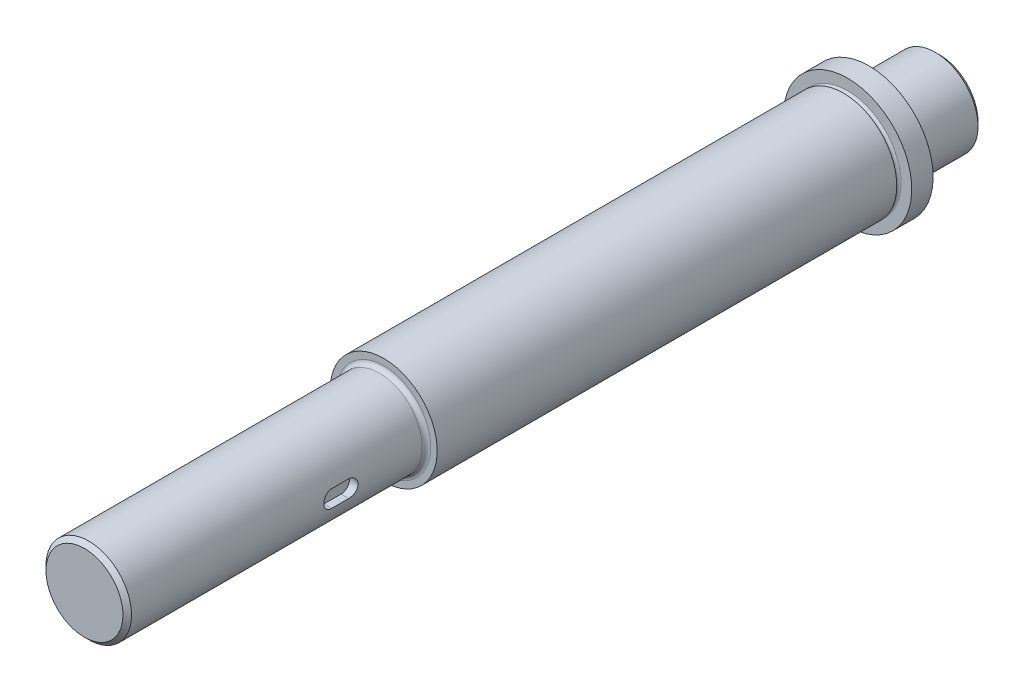
ISO-10303-21;
HEADER;
FILE_DESCRIPTION(('STEP AP214'),'2;1');
FILE_NAME('part.step','',(''),(''),'','','');
FILE_SCHEMA(('AUTOMOTIVE_DESIGN { 1 0 10303 214 1 1 1 1 }'));
ENDSEC;
DATA;
#1=APPLICATION_CONTEXT('core data for automotive mechanical design processes');
#2=APPLICATION_PROTOCOL_DEFINITION('international standard','automotive_design',2000,#1);
#3=PRODUCT_CONTEXT('',#1,'mechanical');
#4=PRODUCT('Part','Part','',(#3));
#5=PRODUCT_RELATED_PRODUCT_CATEGORY('part','',(#4));
#6=PRODUCT_DEFINITION_FORMATION('','',#4);
#7=PRODUCT_DEFINITION_CONTEXT('part definition',#1,'design');
#8=PRODUCT_DEFINITION('design','',#6,#7);
#9=PRODUCT_DEFINITION_SHAPE('','',#8);
#10=(LENGTH_UNIT() NAMED_UNIT(*) SI_UNIT(.MILLI.,.METRE.));
#11=(NAMED_UNIT(*) PLANE_ANGLE_UNIT() SI_UNIT($,.RADIAN.));
#12=(NAMED_UNIT(*) SI_UNIT($,.STERADIAN.) SOLID_ANGLE_UNIT());
#13=UNCERTAINTY_MEASURE_WITH_UNIT(LENGTH_MEASURE(1.E-05),#10,'distance_accuracy_value','');
#14=(GEOMETRIC_REPRESENTATION_CONTEXT(3) GLOBAL_UNCERTAINTY_ASSIGNED_CONTEXT((#13)) GLOBAL_UNIT_ASSIGNED_CONTEXT((#10,
#11,#12)) REPRESENTATION_CONTEXT('',''));
#15=CARTESIAN_POINT('',(0.,0.,0.));
#16=DIRECTION('',(0.,0.,1.));
#17=DIRECTION('',(1.,0.,0.));
#18=AXIS2_PLACEMENT_3D('',#15,#16,#17);
#19=CARTESIAN_POINT('',(0.,-10.,200.));
#20=DIRECTION('',(0.,0.,-1.));
#21=DIRECTION('',(0.,1.,0.));
#22=AXIS2_PLACEMENT_3D('',#19,#20,#21);
#23=PLANE('',#22);
#24=CARTESIAN_POINT('',(0.,0.,200.));
#25=DIRECTION('',(0.,0.,-1.));
#26=DIRECTION('',(0.,1.,0.));
#27=AXIS2_PLACEMENT_3D('',#24,#25,#26);
#28=CIRCLE('',#27,8.99999999999989);
#29=CARTESIAN_POINT('',(0.,8.99999999999986,200.));
#30=VERTEX_POINT('',#29);
#31=EDGE_CURVE('E141',#30,#30,#28,.F.);
#32=ORIENTED_EDGE('',*,*,#31,.T.);
#33=EDGE_LOOP('',(#32));
#34=FACE_BOUND('',#33,.T.);
#35=ADVANCED_FACE('F40',(#34),#23,.F.);
#36=CARTESIAN_POINT('',(0.,0.,0.));
#37=DIRECTION('',(0.,0.,-1.));
#38=DIRECTION('',(0.,1.,0.));
#39=AXIS2_PLACEMENT_3D('',#36,#37,#38);
#40=CYLINDRICAL_SURFACE('',#39,9.99999999999998);
#41=DIRECTION('',(0.,0.,-1.));
#42=VECTOR('',#41,1.);
#43=CARTESIAN_POINT('',(9.7979589711327,-1.99999999999995,0.));
#44=LINE('',#43,#42);
#45=CARTESIAN_POINT('',(9.7979589711327,-2.,148.));
#46=VERTEX_POINT('',#45);
#47=CARTESIAN_POINT('',(9.7979589711327,-2.,152.));
#48=VERTEX_POINT('',#47);
#49=EDGE_CURVE('E63',#46,#48,#44,.F.);
#50=ORIENTED_EDGE('',*,*,#49,.T.);
#51=CARTESIAN_POINT('',(9.7979589711327,-2.,152.));
#52=CARTESIAN_POINT('',(9.79795611157837,-2.00000029709046,152.055667137299));
#53=CARTESIAN_POINT('',(9.7984339846543,-1.99767440405642,152.111307038805));
#54=CARTESIAN_POINT('',(9.8003213815013,-1.98839986829158,152.222177435668));
#55=CARTESIAN_POINT('',(9.80173079002196,-1.98145179742019,152.277407980815));
#56=CARTESIAN_POINT('',(9.80730283285149,-1.95376239954903,152.441709880302));
#57=CARTESIAN_POINT('',(9.81280956758552,-1.92617555297557,152.549662857534));
#58=CARTESIAN_POINT('',(9.82677660401678,-1.85359362042638,152.759285193484));
#59=CARTESIAN_POINT('',(9.83523723174862,-1.80859661275259,152.860953857113));
#60=CARTESIAN_POINT('',(9.85415440257655,-1.70250820881973,153.05532976776));
#61=CARTESIAN_POINT('',(9.86461115250624,-1.64141514447463,153.148036084618));
#62=CARTESIAN_POINT('',(9.88650550448303,-1.50396101869286,153.32311967337));
#63=CARTESIAN_POINT('',(9.89795377776162,-1.42741780364329,153.405352564459));
#64=CARTESIAN_POINT('',(9.92044851228356,-1.26162118198373,153.555908878575));
#65=CARTESIAN_POINT('',(9.93149491105249,-1.17236580968339,153.624230146461));
#66=CARTESIAN_POINT('',(9.95205620855079,-0.982720106800623,153.745577801848));
#67=CARTESIAN_POINT('',(9.96155694564012,-0.882239649550024,153.798465938425));
#68=CARTESIAN_POINT('',(9.97783510908993,-0.673602404217824,153.8865517691));
#69=CARTESIAN_POINT('',(9.98461293824418,-0.565446754297836,153.921752079912));
#70=CARTESIAN_POINT('',(9.99460635553982,-0.346034817774201,153.973014096938));
#71=CARTESIAN_POINT('',(9.99786765043074,-0.234838069152001,153.989321578968));
#72=CARTESIAN_POINT('',(10.0006184349224,-0.01123975349828,154.003101958877));
#73=CARTESIAN_POINT('',(10.000108200481,0.101161724783827,154.000576234757));
#74=CARTESIAN_POINT('',(9.99540868887642,0.322284405513366,153.976947599257));
#75=CARTESIAN_POINT('',(9.99127193663418,0.431035226714444,153.956109900191));
#76=CARTESIAN_POINT('',(9.97984349003514,0.643464013108149,153.896869646048));
#77=CARTESIAN_POINT('',(9.97255169250399,0.747141812282521,153.858466516556));
#78=CARTESIAN_POINT('',(9.95554578241049,0.947240542625905,153.764939193009));
#79=CARTESIAN_POINT('',(9.9458166478219,1.04361145363295,153.709710826148));
#80=CARTESIAN_POINT('',(9.92500903258343,1.22581287576613,153.584179459447));
#81=CARTESIAN_POINT('',(9.91393044014084,1.31164251244036,153.513875210313));
#82=CARTESIAN_POINT('',(9.89142074737008,1.47189241307715,153.35874327675));
#83=CARTESIAN_POINT('',(9.87998686483478,1.54608938999209,153.273685195857));
#84=CARTESIAN_POINT('',(9.85823412232845,1.6792217997989,153.092190483022));
#85=CARTESIAN_POINT('',(9.84791557170813,1.73815300484305,152.995750709668));
#86=CARTESIAN_POINT('',(9.8295546008464,1.83915990928952,152.793895190108));
#87=CARTESIAN_POINT('',(9.82151838996688,1.88118975326899,152.688455953207));
#88=CARTESIAN_POINT('',(9.80872322124985,1.94681419465982,152.471882737489));
#89=CARTESIAN_POINT('',(9.80395938256572,1.97043625496866,152.360757506704));
#90=CARTESIAN_POINT('',(9.80006354383924,1.98966587624393,152.207286366307));
#91=CARTESIAN_POINT('',(9.79927519743983,1.99354251131102,152.165891720435));
#92=CARTESIAN_POINT('',(9.79822334773541,1.9987063293293,152.083004271725));
#93=CARTESIAN_POINT('',(9.79795896609647,1.99999784580931,152.041511750088));
#94=CARTESIAN_POINT('',(9.79795897113268,2.,152.));
#95=B_SPLINE_CURVE_WITH_KNOTS('',3,(#51,#52,#53,#54,#55,#56,#57,#58,#59,#60,#61,#62,#63,#64,#65,
#66,#67,#68,#69,#70,#71,#72,#73,#74,#75,#76,#77,#78,#79,#80,#81,#82,#83,#84,#85,#86,#87,#88,#89,
#90,#91,#92,#93,#94),.UNSPECIFIED.,.F.,.F.,(4,2,2,2,2,2,2,2,2,2,2,2,2,2,2,2,2,2,2,2,2,4),(0.,
0.166897020715845,0.333773396643049,0.666722601037188,0.999708566174051,1.3327290532986,
1.66993288931435,2.00718892413586,2.34737937755189,2.68751948879675,3.02318320738904,
3.35882236614858,3.68967912555434,4.02054670525118,4.3535059711235,4.68649283901805,
5.0252454032929,5.36409168485656,5.70385119298723,6.04310283225101,6.1677880108755,
6.29226399953895),.UNSPECIFIED.);
#96=CARTESIAN_POINT('',(9.79795897113268,2.,152.));
#97=VERTEX_POINT('',#96);
#98=EDGE_CURVE('E144',#48,#97,#95,.T.);
#99=ORIENTED_EDGE('',*,*,#98,.T.);
#100=DIRECTION('',(0.,0.,-1.));
#101=VECTOR('',#100,1.);
#102=CARTESIAN_POINT('',(9.79795897113268,2.00000000000006,0.));
#103=LINE('',#102,#101);
#104=CARTESIAN_POINT('',(9.79795897113268,2.00000000000003,148.));
#105=VERTEX_POINT('',#104);
#106=EDGE_CURVE('E355',#97,#105,#103,.T.);
#107=ORIENTED_EDGE('',*,*,#106,.T.);
#108=CARTESIAN_POINT('',(9.79795897113268,2.,148.));
#109=CARTESIAN_POINT('',(9.79795611157836,2.00000029709046,147.944332862701));
#110=CARTESIAN_POINT('',(9.79843398465429,1.99767440405642,147.888692961195));
#111=CARTESIAN_POINT('',(9.8003213815013,1.98839986829158,147.777822564333));
#112=CARTESIAN_POINT('',(9.80173079002195,1.98145179742019,147.722592019185));
#113=CARTESIAN_POINT('',(9.80730283285148,1.95376239954904,147.558290119698));
#114=CARTESIAN_POINT('',(9.81280956758552,1.92617555297558,147.450337142466));
#115=CARTESIAN_POINT('',(9.82677660401679,1.85359362042637,147.240714806516));
#116=CARTESIAN_POINT('',(9.83523723174862,1.80859661275254,147.139046142887));
#117=CARTESIAN_POINT('',(9.85415440257655,1.70250820881968,146.94467023224));
#118=CARTESIAN_POINT('',(9.86461115250624,1.64141514447462,146.851963915382));
#119=CARTESIAN_POINT('',(9.88650550448303,1.50396101869287,146.67688032663));
#120=CARTESIAN_POINT('',(9.89795377776162,1.42741780364326,146.594647435541));
#121=CARTESIAN_POINT('',(9.92044851228356,1.26162118198369,146.444091121425));
#122=CARTESIAN_POINT('',(9.93149491105249,1.17236580968337,146.375769853539));
#123=CARTESIAN_POINT('',(9.95205620855079,0.982720106800618,146.254422198153));
#124=CARTESIAN_POINT('',(9.96155694564012,0.882239649550001,146.201534061575));
#125=CARTESIAN_POINT('',(9.97783510908993,0.673602404217803,146.113448230901));
#126=CARTESIAN_POINT('',(9.98461293824418,0.565446754297835,146.078247920088));
#127=CARTESIAN_POINT('',(9.99460635553982,0.346034817774211,146.026985903062));
#128=CARTESIAN_POINT('',(9.99786765043074,0.234838069152003,146.010678421032));
#129=CARTESIAN_POINT('',(10.0006184349224,0.011239753498275,145.996898041123));
#130=CARTESIAN_POINT('',(10.000108200481,-0.10116172478383,145.999423765243));
#131=CARTESIAN_POINT('',(9.99540868887642,-0.322284405513361,146.023052400743));
#132=CARTESIAN_POINT('',(9.99127193663418,-0.431035226714434,146.04389009981));
#133=CARTESIAN_POINT('',(9.97984349003514,-0.643464013108145,146.103130353952));
#134=CARTESIAN_POINT('',(9.97255169250399,-0.747141812282528,146.141533483445));
#135=CARTESIAN_POINT('',(9.95554578241049,-0.947240542625897,146.235060806991));
#136=CARTESIAN_POINT('',(9.94581664782191,-1.04361145363291,146.290289173852));
#137=CARTESIAN_POINT('',(9.92500903258344,-1.2258128757661,146.415820540553));
#138=CARTESIAN_POINT('',(9.91393044014084,-1.31164251244036,146.486124789687));
#139=CARTESIAN_POINT('',(9.89142074737008,-1.47189241307715,146.64125672325));
#140=CARTESIAN_POINT('',(9.87998686483478,-1.54608938999206,146.726314804143));
#141=CARTESIAN_POINT('',(9.85823412232847,-1.67922179979887,146.907809516978));
#142=CARTESIAN_POINT('',(9.84791557170814,-1.73815300484305,147.004249290332));
#143=CARTESIAN_POINT('',(9.82955460084641,-1.83915990928953,147.206104809892));
#144=CARTESIAN_POINT('',(9.82151838996689,-1.88118975326898,147.311544046793));
#145=CARTESIAN_POINT('',(9.80872322124986,-1.94681419465981,147.528117262511));
#146=CARTESIAN_POINT('',(9.80395938256574,-1.97043625496866,147.639242493296));
#147=CARTESIAN_POINT('',(9.80006354383925,-1.98966587624394,147.792713633693));
#148=CARTESIAN_POINT('',(9.79927519743984,-1.99354251131102,147.834108279565));
#149=CARTESIAN_POINT('',(9.79822334773542,-1.9987063293293,147.916995728275));
#150=CARTESIAN_POINT('',(9.79795896609648,-1.9999978458093,147.958488249912));
#151=CARTESIAN_POINT('',(9.7979589711327,-2.,148.));
#152=B_SPLINE_CURVE_WITH_KNOTS('',3,(#108,#109,#110,#111,#112,#113,#114,#115,#116,#117,#118,
#119,#120,#121,#122,#123,#124,#125,#126,#127,#128,#129,#130,#131,#132,#133,#134,#135,#136,#137,
#138,#139,#140,#141,#142,#143,#144,#145,#146,#147,#148,#149,#150,#151),.UNSPECIFIED.,.F.,.F.,(4,
2,2,2,2,2,2,2,2,2,2,2,2,2,2,2,2,2,2,2,2,4),(0.,0.166897020715845,0.333773396643049,
0.666722601037242,0.999708566174181,1.3327290532987,1.6699328893144,2.00718892413588,
2.34737937755193,2.6875194887968,3.02318320738907,3.35882236614861,3.68967912555436,
4.02054670525119,4.3535059711235,4.68649283901806,5.02524540329291,5.36409168485656,
5.70385119298722,6.04310283225101,6.16778801087555,6.292263999539),.UNSPECIFIED.);
#153=EDGE_CURVE('E55',#105,#46,#152,.T.);
#154=ORIENTED_EDGE('',*,*,#153,.T.);
#155=EDGE_LOOP('',(#50,#99,#107,#154));
#156=FACE_BOUND('',#155,.T.);
#157=CARTESIAN_POINT('',(0.,0.,199.));
#158=DIRECTION('',(0.,0.,-1.));
#159=DIRECTION('',(0.,1.,0.));
#160=AXIS2_PLACEMENT_3D('',#157,#158,#159);
#161=CIRCLE('',#160,9.99999999999998);
#162=CARTESIAN_POINT('',(0.,9.99999999999995,199.));
#163=VERTEX_POINT('',#162);
#164=EDGE_CURVE('E138',#163,#163,#161,.T.);
#165=ORIENTED_EDGE('',*,*,#164,.T.);
#166=EDGE_LOOP('',(#165));
#167=FACE_BOUND('',#166,.T.);
#168=CARTESIAN_POINT('',(0.,0.,131.));
#169=DIRECTION('',(0.,0.,-1.));
#170=DIRECTION('',(0.,1.,0.));
#171=AXIS2_PLACEMENT_3D('',#168,#169,#170);
#172=CIRCLE('',#171,9.99999999999998);
#173=CARTESIAN_POINT('',(0.,9.99999999999995,131.));
#174=VERTEX_POINT('',#173);
#175=EDGE_CURVE('E129',#174,#174,#172,.F.);
#176=ORIENTED_EDGE('',*,*,#175,.T.);
#177=EDGE_LOOP('',(#176));
#178=FACE_BOUND('',#177,.T.);
#179=ADVANCED_FACE('F159',(#156,#167,#178),#40,.T.);
#180=CARTESIAN_POINT('',(0.,-12.5,130.));
#181=DIRECTION('',(0.,0.,-1.));
#182=DIRECTION('',(0.,1.,0.));
#183=AXIS2_PLACEMENT_3D('',#180,#181,#182);
#184=PLANE('',#183);
#185=CARTESIAN_POINT('',(0.,0.,130.));
#186=DIRECTION('',(0.,0.,-1.));
#187=DIRECTION('',(0.,1.,0.));
#188=AXIS2_PLACEMENT_3D('',#185,#186,#187);
#189=CIRCLE('',#188,11.);
#190=CARTESIAN_POINT('',(0.,11.,130.));
#191=VERTEX_POINT('',#190);
#192=EDGE_CURVE('E126',#191,#191,#189,.T.);
#193=ORIENTED_EDGE('',*,*,#192,.T.);
#194=EDGE_LOOP('',(#193));
#195=FACE_BOUND('',#194,.T.);
#196=CARTESIAN_POINT('',(0.,0.,130.));
#197=DIRECTION('',(0.,0.,-1.));
#198=DIRECTION('',(0.,1.,0.));
#199=AXIS2_PLACEMENT_3D('',#196,#197,#198);
#200=CIRCLE('',#199,12.5);
#201=CARTESIAN_POINT('',(0.,12.5,130.));
#202=VERTEX_POINT('',#201);
#203=EDGE_CURVE('E123',#202,#202,#200,.T.);
#204=ORIENTED_EDGE('',*,*,#203,.F.);
#205=EDGE_LOOP('',(#204));
#206=FACE_BOUND('',#205,.T.);
#207=ADVANCED_FACE('F203',(#195,#206),#184,.F.);
#208=CARTESIAN_POINT('',(0.,0.,0.));
#209=DIRECTION('',(0.,0.,-1.));
#210=DIRECTION('',(0.,1.,0.));
#211=AXIS2_PLACEMENT_3D('',#208,#209,#210);
#212=CYLINDRICAL_SURFACE('',#211,12.5);
#213=CARTESIAN_POINT('',(0.,0.,22.5));
#214=DIRECTION('',(0.,0.,-1.));
#215=DIRECTION('',(0.,1.,0.));
#216=AXIS2_PLACEMENT_3D('',#213,#214,#215);
#217=CIRCLE('',#216,12.5);
#218=CARTESIAN_POINT('',(0.,12.5,22.5));
#219=VERTEX_POINT('',#218);
#220=EDGE_CURVE('E120',#219,#219,#217,.T.);
#221=ORIENTED_EDGE('',*,*,#220,.F.);
#222=EDGE_LOOP('',(#221));
#223=FACE_BOUND('',#222,.T.);
#224=ORIENTED_EDGE('',*,*,#203,.T.);
#225=EDGE_LOOP('',(#224));
#226=FACE_BOUND('',#225,.T.);
#227=ADVANCED_FACE('F200',(#223,#226),#212,.T.);
#228=CARTESIAN_POINT('',(0.,0.,22.));
#229=DIRECTION('',(0.,0.,-1.));
#230=DIRECTION('',(0.,1.,0.));
#231=AXIS2_PLACEMENT_3D('',#228,#229,#230);
#232=TOROIDAL_SURFACE('',#231,12.5,0.500000000000002);
#233=CARTESIAN_POINT('',(0.,0.,21.5));
#234=DIRECTION('',(0.,0.,-1.));
#235=DIRECTION('',(0.,1.,0.));
#236=AXIS2_PLACEMENT_3D('',#233,#234,#235);
#237=CIRCLE('',#236,12.5);
#238=CARTESIAN_POINT('',(0.,12.5,21.5));
#239=VERTEX_POINT('',#238);
#240=EDGE_CURVE('E117',#239,#239,#237,.T.);
#241=ORIENTED_EDGE('',*,*,#240,.F.);
#242=EDGE_LOOP('',(#241));
#243=FACE_BOUND('',#242,.T.);
#244=ORIENTED_EDGE('',*,*,#220,.T.);
#245=EDGE_LOOP('',(#244));
#246=FACE_BOUND('',#245,.T.);
#247=ADVANCED_FACE('F196',(#243,#246),#232,.F.);
#248=CARTESIAN_POINT('',(0.,-12.5,21.5));
#249=DIRECTION('',(0.,0.,-1.));
#250=DIRECTION('',(0.,1.,0.));
#251=AXIS2_PLACEMENT_3D('',#248,#249,#250);
#252=PLANE('',#251);
#253=CARTESIAN_POINT('',(0.,0.,21.5));
#254=DIRECTION('',(0.,0.,-1.));
#255=DIRECTION('',(0.,1.,0.));
#256=AXIS2_PLACEMENT_3D('',#253,#254,#255);
#257=CIRCLE('',#256,15.);
#258=CARTESIAN_POINT('',(0.,15.,21.5));
#259=VERTEX_POINT('',#258);
#260=EDGE_CURVE('E114',#259,#259,#257,.T.);
#261=ORIENTED_EDGE('',*,*,#260,.F.);
#262=EDGE_LOOP('',(#261));
#263=FACE_BOUND('',#262,.T.);
#264=ORIENTED_EDGE('',*,*,#240,.T.);
#265=EDGE_LOOP('',(#264));
#266=FACE_BOUND('',#265,.T.);
#267=ADVANCED_FACE('F192',(#263,#266),#252,.F.);
#268=CARTESIAN_POINT('',(0.,0.,0.));
#269=DIRECTION('',(0.,0.,-1.));
#270=DIRECTION('',(0.,1.,0.));
#271=AXIS2_PLACEMENT_3D('',#268,#269,#270);
#272=CYLINDRICAL_SURFACE('',#271,15.);
#273=CARTESIAN_POINT('',(0.,0.,16.5));
#274=DIRECTION('',(0.,0.,-1.));
#275=DIRECTION('',(0.,1.,0.));
#276=AXIS2_PLACEMENT_3D('',#273,#274,#275);
#277=CIRCLE('',#276,15.);
#278=CARTESIAN_POINT('',(0.,15.,16.5));
#279=VERTEX_POINT('',#278);
#280=EDGE_CURVE('E108',#279,#279,#277,.T.);
#281=ORIENTED_EDGE('',*,*,#280,.F.);
#282=EDGE_LOOP('',(#281));
#283=FACE_BOUND('',#282,.T.);
#284=ORIENTED_EDGE('',*,*,#260,.T.);
#285=EDGE_LOOP('',(#284));
#286=FACE_BOUND('',#285,.T.);
#287=ADVANCED_FACE('F188',(#283,#286),#272,.T.);
#288=CARTESIAN_POINT('',(0.,-15.,16.5));
#289=DIRECTION('',(0.,0.,1.));
#290=DIRECTION('',(0.,-1.,0.));
#291=AXIS2_PLACEMENT_3D('',#288,#289,#290);
#292=PLANE('',#291);
#293=CARTESIAN_POINT('',(0.,0.,16.5));
#294=DIRECTION('',(0.,0.,1.));
#295=DIRECTION('',(0.,-1.,0.));
#296=AXIS2_PLACEMENT_3D('',#293,#294,#295);
#297=CIRCLE('',#296,13.);
#298=CARTESIAN_POINT('',(0.,-13.,16.5));
#299=VERTEX_POINT('',#298);
#300=EDGE_CURVE('E135',#299,#299,#297,.T.);
#301=ORIENTED_EDGE('',*,*,#300,.T.);
#302=EDGE_LOOP('',(#301));
#303=FACE_BOUND('',#302,.T.);
#304=ORIENTED_EDGE('',*,*,#280,.T.);
#305=EDGE_LOOP('',(#304));
#306=FACE_BOUND('',#305,.T.);
#307=ADVANCED_FACE('F184',(#303,#306),#292,.F.);
#308=CARTESIAN_POINT('',(0.,0.,0.));
#309=DIRECTION('',(0.,0.,-1.));
#310=DIRECTION('',(0.,1.,0.));
#311=AXIS2_PLACEMENT_3D('',#308,#309,#310);
#312=CYLINDRICAL_SURFACE('',#311,10.);
#313=CARTESIAN_POINT('',(0.,0.,1.));
#314=DIRECTION('',(0.,0.,1.));
#315=DIRECTION('',(0.,-1.,0.));
#316=AXIS2_PLACEMENT_3D('',#313,#314,#315);
#317=CIRCLE('',#316,10.);
#318=CARTESIAN_POINT('',(0.,-10.,1.));
#319=VERTEX_POINT('',#318);
#320=EDGE_CURVE('E11',#319,#319,#317,.T.);
#321=ORIENTED_EDGE('',*,*,#320,.T.);
#322=EDGE_LOOP('',(#321));
#323=FACE_BOUND('',#322,.T.);
#324=CARTESIAN_POINT('',(0.,0.,13.5));
#325=DIRECTION('',(0.,0.,1.));
#326=DIRECTION('',(0.,-1.,0.));
#327=AXIS2_PLACEMENT_3D('',#324,#325,#326);
#328=CIRCLE('',#327,10.);
#329=CARTESIAN_POINT('',(0.,-10.,13.5));
#330=VERTEX_POINT('',#329);
#331=EDGE_CURVE('E132',#330,#330,#328,.F.);
#332=ORIENTED_EDGE('',*,*,#331,.T.);
#333=EDGE_LOOP('',(#332));
#334=FACE_BOUND('',#333,.T.);
#335=ADVANCED_FACE('F180',(#323,#334),#312,.T.);
#336=CARTESIAN_POINT('',(0.,0.,0.));
#337=DIRECTION('',(0.,0.,1.));
#338=DIRECTION('',(0.,-1.,0.));
#339=AXIS2_PLACEMENT_3D('',#336,#337,#338);
#340=PLANE('',#339);
#341=CARTESIAN_POINT('',(0.,0.,0.));
#342=DIRECTION('',(0.,0.,1.));
#343=DIRECTION('',(0.,-1.,0.));
#344=AXIS2_PLACEMENT_3D('',#341,#342,#343);
#345=CIRCLE('',#344,9.00000000000001);
#346=CARTESIAN_POINT('',(0.,-9.00000000000001,0.));
#347=VERTEX_POINT('',#346);
#348=EDGE_CURVE('E48',#347,#347,#345,.F.);
#349=ORIENTED_EDGE('',*,*,#348,.T.);
#350=EDGE_LOOP('',(#349));
#351=FACE_BOUND('',#350,.T.);
#352=ADVANCED_FACE('F176',(#351),#340,.F.);
#353=CARTESIAN_POINT('',(0.,0.,131.));
#354=DIRECTION('',(0.,0.,-1.));
#355=DIRECTION('',(0.,1.,0.));
#356=AXIS2_PLACEMENT_3D('',#353,#354,#355);
#357=TOROIDAL_SURFACE('',#356,11.,1.);
#358=ORIENTED_EDGE('',*,*,#175,.F.);
#359=EDGE_LOOP('',(#358));
#360=FACE_BOUND('',#359,.T.);
#361=ORIENTED_EDGE('',*,*,#192,.F.);
#362=EDGE_LOOP('',(#361));
#363=FACE_BOUND('',#362,.T.);
#364=ADVANCED_FACE('F179',(#360,#363),#357,.F.);
#365=CARTESIAN_POINT('',(0.,0.,13.5));
#366=DIRECTION('',(0.,0.,1.));
#367=DIRECTION('',(0.,-1.,0.));
#368=AXIS2_PLACEMENT_3D('',#365,#366,#367);
#369=TOROIDAL_SURFACE('',#368,13.,3.);
#370=ORIENTED_EDGE('',*,*,#300,.F.);
#371=EDGE_LOOP('',(#370));
#372=FACE_BOUND('',#371,.T.);
#373=ORIENTED_EDGE('',*,*,#331,.F.);
#374=EDGE_LOOP('',(#373));
#375=FACE_BOUND('',#374,.T.);
#376=ADVANCED_FACE('F219',(#372,#375),#369,.F.);
#377=CARTESIAN_POINT('',(0.,0.,199.));
#378=DIRECTION('',(0.,0.,-1.));
#379=DIRECTION('',(0.,1.,0.));
#380=AXIS2_PLACEMENT_3D('',#377,#378,#379);
#381=CONICAL_SURFACE('',#380,9.99999999999998,0.785398163397463);
#382=ORIENTED_EDGE('',*,*,#31,.F.);
#383=EDGE_LOOP('',(#382));
#384=FACE_BOUND('',#383,.T.);
#385=ORIENTED_EDGE('',*,*,#164,.F.);
#386=EDGE_LOOP('',(#385));
#387=FACE_BOUND('',#386,.T.);
#388=ADVANCED_FACE('F175',(#384,#387),#381,.T.);
#389=CARTESIAN_POINT('',(7.99999999999999,0.,148.));
#390=DIRECTION('',(1.,0.,0.));
#391=DIRECTION('',(0.,0.,-1.));
#392=AXIS2_PLACEMENT_3D('',#389,#390,#391);
#393=CYLINDRICAL_SURFACE('',#392,2.);
#394=DIRECTION('',(1.,0.,0.));
#395=VECTOR('',#394,1.);
#396=CARTESIAN_POINT('',(7.99999999999999,2.,148.));
#397=LINE('',#396,#395);
#398=CARTESIAN_POINT('',(7.99999999999999,2.,148.));
#399=VERTEX_POINT('',#398);
#400=EDGE_CURVE('E80',#399,#105,#397,.T.);
#401=ORIENTED_EDGE('',*,*,#400,.F.);
#402=CARTESIAN_POINT('',(7.99999999999999,0.,148.));
#403=DIRECTION('',(1.,0.,0.));
#404=DIRECTION('',(0.,0.,-1.));
#405=AXIS2_PLACEMENT_3D('',#402,#403,#404);
#406=CIRCLE('',#405,2.);
#407=CARTESIAN_POINT('',(7.99999999999999,-2.,148.));
#408=VERTEX_POINT('',#407);
#409=EDGE_CURVE('E84',#408,#399,#406,.T.);
#410=ORIENTED_EDGE('',*,*,#409,.F.);
#411=DIRECTION('',(1.,0.,0.));
#412=VECTOR('',#411,1.);
#413=CARTESIAN_POINT('',(7.99999999999999,-2.,148.));
#414=LINE('',#413,#412);
#415=EDGE_CURVE('E106',#408,#46,#414,.T.);
#416=ORIENTED_EDGE('',*,*,#415,.T.);
#417=ORIENTED_EDGE('',*,*,#153,.F.);
#418=EDGE_LOOP('',(#401,#410,#416,#417));
#419=FACE_BOUND('',#418,.T.);
#420=ADVANCED_FACE('F82',(#419),#393,.F.);
#421=CARTESIAN_POINT('',(7.99999999999999,-2.,148.));
#422=DIRECTION('',(0.,-1.,0.));
#423=DIRECTION('',(0.,0.,-1.));
#424=AXIS2_PLACEMENT_3D('',#421,#422,#423);
#425=PLANE('',#424);
#426=ORIENTED_EDGE('',*,*,#415,.F.);
#427=DIRECTION('',(0.,0.,-1.));
#428=VECTOR('',#427,1.);
#429=CARTESIAN_POINT('',(7.99999999999999,-2.,148.));
#430=LINE('',#429,#428);
#431=CARTESIAN_POINT('',(7.99999999999999,-2.,152.));
#432=VERTEX_POINT('',#431);
#433=EDGE_CURVE('E89',#432,#408,#430,.T.);
#434=ORIENTED_EDGE('',*,*,#433,.F.);
#435=DIRECTION('',(1.,0.,0.));
#436=VECTOR('',#435,1.);
#437=CARTESIAN_POINT('',(7.99999999999999,-2.,152.));
#438=LINE('',#437,#436);
#439=EDGE_CURVE('E109',#432,#48,#438,.T.);
#440=ORIENTED_EDGE('',*,*,#439,.T.);
#441=ORIENTED_EDGE('',*,*,#49,.F.);
#442=EDGE_LOOP('',(#426,#434,#440,#441));
#443=FACE_BOUND('',#442,.T.);
#444=ADVANCED_FACE('F168',(#443),#425,.F.);
#445=CARTESIAN_POINT('',(7.99999999999999,0.,152.));
#446=DIRECTION('',(1.,0.,0.));
#447=DIRECTION('',(0.,0.,-1.));
#448=AXIS2_PLACEMENT_3D('',#445,#446,#447);
#449=CYLINDRICAL_SURFACE('',#448,2.);
#450=ORIENTED_EDGE('',*,*,#439,.F.);
#451=CARTESIAN_POINT('',(7.99999999999999,0.,152.));
#452=DIRECTION('',(1.,0.,0.));
#453=DIRECTION('',(0.,0.,-1.));
#454=AXIS2_PLACEMENT_3D('',#451,#452,#453);
#455=CIRCLE('',#454,2.);
#456=CARTESIAN_POINT('',(7.99999999999999,2.,152.));
#457=VERTEX_POINT('',#456);
#458=EDGE_CURVE('E98',#457,#432,#455,.T.);
#459=ORIENTED_EDGE('',*,*,#458,.F.);
#460=DIRECTION('',(1.,0.,0.));
#461=VECTOR('',#460,1.);
#462=CARTESIAN_POINT('',(7.99999999999999,2.,152.));
#463=LINE('',#462,#461);
#464=EDGE_CURVE('E88',#457,#97,#463,.T.);
#465=ORIENTED_EDGE('',*,*,#464,.T.);
#466=ORIENTED_EDGE('',*,*,#98,.F.);
#467=EDGE_LOOP('',(#450,#459,#465,#466));
#468=FACE_BOUND('',#467,.T.);
#469=ADVANCED_FACE('F163',(#468),#449,.F.);
#470=CARTESIAN_POINT('',(7.99999999999999,2.,148.));
#471=DIRECTION('',(0.,1.,0.));
#472=DIRECTION('',(0.,0.,1.));
#473=AXIS2_PLACEMENT_3D('',#470,#471,#472);
#474=PLANE('',#473);
#475=ORIENTED_EDGE('',*,*,#464,.F.);
#476=DIRECTION('',(0.,0.,1.));
#477=VECTOR('',#476,1.);
#478=CARTESIAN_POINT('',(7.99999999999999,2.,148.));
#479=LINE('',#478,#477);
#480=EDGE_CURVE('E92',#399,#457,#479,.T.);
#481=ORIENTED_EDGE('',*,*,#480,.F.);
#482=ORIENTED_EDGE('',*,*,#400,.T.);
#483=ORIENTED_EDGE('',*,*,#106,.F.);
#484=EDGE_LOOP('',(#475,#481,#482,#483));
#485=FACE_BOUND('',#484,.T.);
#486=ADVANCED_FACE('F93',(#485),#474,.F.);
#487=CARTESIAN_POINT('',(7.99999999999999,0.,148.));
#488=DIRECTION('',(1.,0.,0.));
#489=DIRECTION('',(0.,0.,-1.));
#490=AXIS2_PLACEMENT_3D('',#487,#488,#489);
#491=PLANE('',#490);
#492=ORIENTED_EDGE('',*,*,#409,.T.);
#493=ORIENTED_EDGE('',*,*,#480,.T.);
#494=ORIENTED_EDGE('',*,*,#458,.T.);
#495=ORIENTED_EDGE('',*,*,#433,.T.);
#496=EDGE_LOOP('',(#492,#493,#494,#495));
#497=FACE_BOUND('',#496,.T.);
#498=ADVANCED_FACE('F100',(#497),#491,.T.);
#499=CARTESIAN_POINT('',(0.,0.,0.));
#500=DIRECTION('',(0.,0.,1.));
#501=DIRECTION('',(0.,-1.,0.));
#502=AXIS2_PLACEMENT_3D('',#499,#500,#501);
#503=CONICAL_SURFACE('',#502,9.00000000000001,0.785398163397445);
#504=ORIENTED_EDGE('',*,*,#320,.F.);
#505=EDGE_LOOP('',(#504));
#506=FACE_BOUND('',#505,.T.);
#507=ORIENTED_EDGE('',*,*,#348,.F.);
#508=EDGE_LOOP('',(#507));
#509=FACE_BOUND('',#508,.T.);
#510=ADVANCED_FACE('F42',(#506,#509),#503,.T.);
#511=CLOSED_SHELL('',(#35,#179,#207,#227,#247,#267,#287,#307,#335,#352,#364,#376,#388,#420,#444,
#469,#486,#498,#510));
#512=MANIFOLD_SOLID_BREP('B2',#511);
#513=ADVANCED_BREP_SHAPE_REPRESENTATION('',(#18,#512),#14);
#514=SHAPE_DEFINITION_REPRESENTATION(#9,#513);
ENDSEC;
END-ISO-10303-21;
